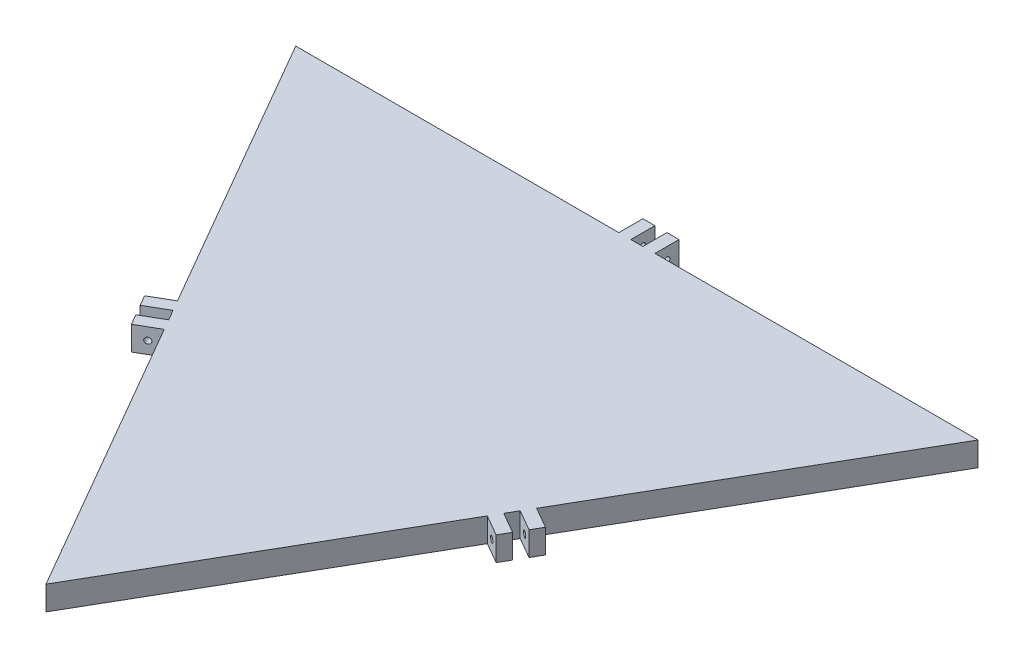
ISO-10303-21;
HEADER;
FILE_DESCRIPTION(('STEP AP214'),'2;1');
FILE_NAME('part.step','',(''),(''),'','','');
FILE_SCHEMA(('AUTOMOTIVE_DESIGN { 1 0 10303 214 1 1 1 1 }'));
ENDSEC;
DATA;
#1=APPLICATION_CONTEXT('core data for automotive mechanical design processes');
#2=APPLICATION_PROTOCOL_DEFINITION('international standard','automotive_design',2000,#1);
#3=PRODUCT_CONTEXT('',#1,'mechanical');
#4=PRODUCT('Part','Part','',(#3));
#5=PRODUCT_RELATED_PRODUCT_CATEGORY('part','',(#4));
#6=PRODUCT_DEFINITION_FORMATION('','',#4);
#7=PRODUCT_DEFINITION_CONTEXT('part definition',#1,'design');
#8=PRODUCT_DEFINITION('design','',#6,#7);
#9=PRODUCT_DEFINITION_SHAPE('','',#8);
#10=(LENGTH_UNIT() NAMED_UNIT(*) SI_UNIT(.MILLI.,.METRE.));
#11=(NAMED_UNIT(*) PLANE_ANGLE_UNIT() SI_UNIT($,.RADIAN.));
#12=(NAMED_UNIT(*) SI_UNIT($,.STERADIAN.) SOLID_ANGLE_UNIT());
#13=UNCERTAINTY_MEASURE_WITH_UNIT(LENGTH_MEASURE(1.E-05),#10,'distance_accuracy_value','');
#14=(GEOMETRIC_REPRESENTATION_CONTEXT(3) GLOBAL_UNCERTAINTY_ASSIGNED_CONTEXT((#13)) GLOBAL_UNIT_ASSIGNED_CONTEXT((#10,
#11,#12)) REPRESENTATION_CONTEXT('',''));
#15=CARTESIAN_POINT('',(0.,0.,0.));
#16=DIRECTION('',(0.,0.,1.));
#17=DIRECTION('',(1.,0.,0.));
#18=AXIS2_PLACEMENT_3D('',#15,#16,#17);
#19=CARTESIAN_POINT('',(-283.5,20.,-163.678801315259));
#20=DIRECTION('',(0.,0.,-1.));
#21=DIRECTION('',(-1.,0.,0.));
#22=AXIS2_PLACEMENT_3D('',#19,#20,#21);
#23=PLANE('',#22);
#24=DIRECTION('',(0.,-1.,0.));
#25=VECTOR('',#24,1.);
#26=CARTESIAN_POINT('',(4.99999999999985,20.,-163.678801315259));
#27=LINE('',#26,#25);
#28=CARTESIAN_POINT('',(4.99999999999984,20.,-163.678801315259));
#29=VERTEX_POINT('',#28);
#30=CARTESIAN_POINT('',(4.99999999999984,0.,-163.678801315259));
#31=VERTEX_POINT('',#30);
#32=EDGE_CURVE('E95',#29,#31,#27,.T.);
#33=ORIENTED_EDGE('',*,*,#32,.T.);
#34=DIRECTION('',(1.,0.,0.));
#35=VECTOR('',#34,1.);
#36=CARTESIAN_POINT('',(-283.5,0.,-163.678801315259));
#37=LINE('',#36,#35);
#38=CARTESIAN_POINT('',(-5.00000000000017,0.,-163.678801315259));
#39=VERTEX_POINT('',#38);
#40=EDGE_CURVE('E529',#39,#31,#37,.T.);
#41=ORIENTED_EDGE('',*,*,#40,.F.);
#42=DIRECTION('',(0.,1.,0.));
#43=VECTOR('',#42,1.);
#44=CARTESIAN_POINT('',(-5.00000000000017,20.,-163.678801315259));
#45=LINE('',#44,#43);
#46=CARTESIAN_POINT('',(-5.00000000000017,20.,-163.678801315259));
#47=VERTEX_POINT('',#46);
#48=EDGE_CURVE('E262',#39,#47,#45,.T.);
#49=ORIENTED_EDGE('',*,*,#48,.T.);
#50=DIRECTION('',(1.,0.,0.));
#51=VECTOR('',#50,1.);
#52=CARTESIAN_POINT('',(-283.5,20.,-163.678801315259));
#53=LINE('',#52,#51);
#54=EDGE_CURVE('E524',#47,#29,#53,.T.);
#55=ORIENTED_EDGE('',*,*,#54,.T.);
#56=EDGE_LOOP('',(#33,#41,#49,#55));
#57=FACE_BOUND('',#56,.T.);
#58=ADVANCED_FACE('F69',(#57),#23,.T.);
#59=DIRECTION('',(0.,1.,0.));
#60=VECTOR('',#59,1.);
#61=CARTESIAN_POINT('',(14.9999999999999,20.,-163.678801315259));
#62=LINE('',#61,#60);
#63=CARTESIAN_POINT('',(14.9999999999998,0.,-163.678801315259));
#64=VERTEX_POINT('',#63);
#65=CARTESIAN_POINT('',(14.9999999999999,20.,-163.678801315259));
#66=VERTEX_POINT('',#65);
#67=EDGE_CURVE('E274',#64,#66,#62,.T.);
#68=ORIENTED_EDGE('',*,*,#67,.T.);
#69=CARTESIAN_POINT('',(283.5,20.,-163.678801315259));
#70=VERTEX_POINT('',#69);
#71=EDGE_CURVE('E525',#66,#70,#53,.T.);
#72=ORIENTED_EDGE('',*,*,#71,.T.);
#73=DIRECTION('',(0.,-1.,0.));
#74=VECTOR('',#73,1.);
#75=CARTESIAN_POINT('',(283.5,20.,-163.678801315259));
#76=LINE('',#75,#74);
#77=CARTESIAN_POINT('',(283.5,0.,-163.678801315259));
#78=VERTEX_POINT('',#77);
#79=EDGE_CURVE('E73',#70,#78,#76,.T.);
#80=ORIENTED_EDGE('',*,*,#79,.T.);
#81=EDGE_CURVE('E87',#64,#78,#37,.T.);
#82=ORIENTED_EDGE('',*,*,#81,.F.);
#83=EDGE_LOOP('',(#68,#72,#80,#82));
#84=FACE_BOUND('',#83,.T.);
#85=ADVANCED_FACE('F71',(#84),#23,.T.);
#86=CARTESIAN_POINT('',(-283.5,20.,-163.678801315259));
#87=VERTEX_POINT('',#86);
#88=CARTESIAN_POINT('',(-15.0000000000002,20.,-163.678801315259));
#89=VERTEX_POINT('',#88);
#90=EDGE_CURVE('E519',#87,#89,#53,.T.);
#91=ORIENTED_EDGE('',*,*,#90,.T.);
#92=DIRECTION('',(0.,-1.,0.));
#93=VECTOR('',#92,1.);
#94=CARTESIAN_POINT('',(-15.0000000000002,20.,-163.678801315259));
#95=LINE('',#94,#93);
#96=CARTESIAN_POINT('',(-15.0000000000002,0.,-163.678801315259));
#97=VERTEX_POINT('',#96);
#98=EDGE_CURVE('E309',#89,#97,#95,.T.);
#99=ORIENTED_EDGE('',*,*,#98,.T.);
#100=CARTESIAN_POINT('',(-283.5,0.,-163.678801315259));
#101=VERTEX_POINT('',#100);
#102=EDGE_CURVE('E526',#101,#97,#37,.T.);
#103=ORIENTED_EDGE('',*,*,#102,.F.);
#104=DIRECTION('',(0.,-1.,0.));
#105=VECTOR('',#104,1.);
#106=CARTESIAN_POINT('',(-283.5,20.,-163.678801315259));
#107=LINE('',#106,#105);
#108=EDGE_CURVE('E523',#87,#101,#107,.T.);
#109=ORIENTED_EDGE('',*,*,#108,.F.);
#110=EDGE_LOOP('',(#91,#99,#103,#109));
#111=FACE_BOUND('',#110,.T.);
#112=ADVANCED_FACE('F601',(#111),#23,.T.);
#113=CARTESIAN_POINT('',(-141.75,20.,81.8394006576295));
#114=DIRECTION('',(-0.866025403784439,0.,0.5));
#115=DIRECTION('',(0.5,0.,0.866025403784439));
#116=AXIS2_PLACEMENT_3D('',#113,#114,#115);
#117=PLANE('',#116);
#118=DIRECTION('',(0.,-1.,0.));
#119=VECTOR('',#118,1.);
#120=CARTESIAN_POINT('',(-144.25,20.,77.5092736387074));
#121=LINE('',#120,#119);
#122=CARTESIAN_POINT('',(-144.25,20.,77.5092736387073));
#123=VERTEX_POINT('',#122);
#124=CARTESIAN_POINT('',(-144.25,0.,77.5092736387073));
#125=VERTEX_POINT('',#124);
#126=EDGE_CURVE('E339',#123,#125,#121,.T.);
#127=ORIENTED_EDGE('',*,*,#126,.T.);
#128=DIRECTION('',(-0.5,0.,-0.866025403784439));
#129=VECTOR('',#128,1.);
#130=CARTESIAN_POINT('',(-141.75,0.,81.8394006576295));
#131=LINE('',#130,#129);
#132=CARTESIAN_POINT('',(-139.25,0.,86.1695276765518));
#133=VERTEX_POINT('',#132);
#134=EDGE_CURVE('E517',#133,#125,#131,.T.);
#135=ORIENTED_EDGE('',*,*,#134,.F.);
#136=DIRECTION('',(0.,1.,0.));
#137=VECTOR('',#136,1.);
#138=CARTESIAN_POINT('',(-139.25,20.,86.1695276765518));
#139=LINE('',#138,#137);
#140=CARTESIAN_POINT('',(-139.25,20.,86.1695276765518));
#141=VERTEX_POINT('',#140);
#142=EDGE_CURVE('E377',#133,#141,#139,.T.);
#143=ORIENTED_EDGE('',*,*,#142,.T.);
#144=DIRECTION('',(-0.5,0.,-0.866025403784439));
#145=VECTOR('',#144,1.);
#146=CARTESIAN_POINT('',(-141.75,20.,81.8394006576295));
#147=LINE('',#146,#145);
#148=EDGE_CURVE('E507',#141,#123,#147,.T.);
#149=ORIENTED_EDGE('',*,*,#148,.T.);
#150=EDGE_LOOP('',(#127,#135,#143,#149));
#151=FACE_BOUND('',#150,.T.);
#152=ADVANCED_FACE('F605',(#151),#117,.T.);
#153=DIRECTION('',(0.,1.,0.));
#154=VECTOR('',#153,1.);
#155=CARTESIAN_POINT('',(-149.25,20.,68.849019600863));
#156=LINE('',#155,#154);
#157=CARTESIAN_POINT('',(-149.25,0.,68.849019600863));
#158=VERTEX_POINT('',#157);
#159=CARTESIAN_POINT('',(-149.25,20.,68.849019600863));
#160=VERTEX_POINT('',#159);
#161=EDGE_CURVE('E345',#158,#160,#156,.T.);
#162=ORIENTED_EDGE('',*,*,#161,.T.);
#163=EDGE_CURVE('E501',#160,#87,#147,.T.);
#164=ORIENTED_EDGE('',*,*,#163,.T.);
#165=ORIENTED_EDGE('',*,*,#108,.T.);
#166=EDGE_CURVE('E511',#158,#101,#131,.T.);
#167=ORIENTED_EDGE('',*,*,#166,.F.);
#168=EDGE_LOOP('',(#162,#164,#165,#167));
#169=FACE_BOUND('',#168,.T.);
#170=ADVANCED_FACE('F609',(#169),#117,.T.);
#171=CARTESIAN_POINT('',(0.,20.,327.357602630518));
#172=VERTEX_POINT('',#171);
#173=CARTESIAN_POINT('',(-134.25,20.,94.8297817143962));
#174=VERTEX_POINT('',#173);
#175=EDGE_CURVE('E79',#172,#174,#147,.T.);
#176=ORIENTED_EDGE('',*,*,#175,.T.);
#177=DIRECTION('',(0.,-1.,0.));
#178=VECTOR('',#177,1.);
#179=CARTESIAN_POINT('',(-134.25,20.,94.8297817143962));
#180=LINE('',#179,#178);
#181=CARTESIAN_POINT('',(-134.25,0.,94.8297817143961));
#182=VERTEX_POINT('',#181);
#183=EDGE_CURVE('E383',#174,#182,#180,.T.);
#184=ORIENTED_EDGE('',*,*,#183,.T.);
#185=CARTESIAN_POINT('',(0.,0.,327.357602630518));
#186=VERTEX_POINT('',#185);
#187=EDGE_CURVE('E514',#186,#182,#131,.T.);
#188=ORIENTED_EDGE('',*,*,#187,.F.);
#189=DIRECTION('',(0.,-1.,0.));
#190=VECTOR('',#189,1.);
#191=CARTESIAN_POINT('',(0.,20.,327.357602630518));
#192=LINE('',#191,#190);
#193=EDGE_CURVE('E12',#172,#186,#192,.T.);
#194=ORIENTED_EDGE('',*,*,#193,.F.);
#195=EDGE_LOOP('',(#176,#184,#188,#194));
#196=FACE_BOUND('',#195,.T.);
#197=ADVANCED_FACE('F578',(#196),#117,.T.);
#198=CARTESIAN_POINT('',(141.75,20.,81.8394006576295));
#199=DIRECTION('',(-0.866025403784439,0.,-0.5));
#200=DIRECTION('',(-0.5,0.,0.866025403784439));
#201=AXIS2_PLACEMENT_3D('',#198,#199,#200);
#202=PLANE('',#201);
#203=DIRECTION('',(0.,-1.,0.));
#204=VECTOR('',#203,1.);
#205=CARTESIAN_POINT('',(144.25,20.,77.5092736387074));
#206=LINE('',#205,#204);
#207=CARTESIAN_POINT('',(144.25,20.,77.5092736387074));
#208=VERTEX_POINT('',#207);
#209=CARTESIAN_POINT('',(144.25,0.,77.5092736387074));
#210=VERTEX_POINT('',#209);
#211=EDGE_CURVE('E446',#208,#210,#206,.T.);
#212=ORIENTED_EDGE('',*,*,#211,.F.);
#213=DIRECTION('',(0.5,0.,-0.866025403784439));
#214=VECTOR('',#213,1.);
#215=CARTESIAN_POINT('',(141.75,20.,81.8394006576295));
#216=LINE('',#215,#214);
#217=CARTESIAN_POINT('',(139.25,20.,86.1695276765518));
#218=VERTEX_POINT('',#217);
#219=EDGE_CURVE('E502',#218,#208,#216,.T.);
#220=ORIENTED_EDGE('',*,*,#219,.F.);
#221=DIRECTION('',(0.,1.,0.));
#222=VECTOR('',#221,1.);
#223=CARTESIAN_POINT('',(139.25,20.,86.1695276765518));
#224=LINE('',#223,#222);
#225=CARTESIAN_POINT('',(139.25,0.,86.1695276765518));
#226=VERTEX_POINT('',#225);
#227=EDGE_CURVE('E451',#226,#218,#224,.T.);
#228=ORIENTED_EDGE('',*,*,#227,.F.);
#229=DIRECTION('',(0.5,0.,-0.866025403784439));
#230=VECTOR('',#229,1.);
#231=CARTESIAN_POINT('',(141.75,0.,81.8394006576295));
#232=LINE('',#231,#230);
#233=EDGE_CURVE('E512',#226,#210,#232,.T.);
#234=ORIENTED_EDGE('',*,*,#233,.T.);
#235=EDGE_LOOP('',(#212,#220,#228,#234));
#236=FACE_BOUND('',#235,.T.);
#237=ADVANCED_FACE('F552',(#236),#202,.F.);
#238=DIRECTION('',(0.,1.,0.));
#239=VECTOR('',#238,1.);
#240=CARTESIAN_POINT('',(149.25,20.,68.849019600863));
#241=LINE('',#240,#239);
#242=CARTESIAN_POINT('',(149.25,0.,68.849019600863));
#243=VERTEX_POINT('',#242);
#244=CARTESIAN_POINT('',(149.25,20.,68.849019600863));
#245=VERTEX_POINT('',#244);
#246=EDGE_CURVE('E442',#243,#245,#241,.T.);
#247=ORIENTED_EDGE('',*,*,#246,.F.);
#248=EDGE_CURVE('E513',#243,#78,#232,.T.);
#249=ORIENTED_EDGE('',*,*,#248,.T.);
#250=ORIENTED_EDGE('',*,*,#79,.F.);
#251=EDGE_CURVE('E503',#245,#70,#216,.T.);
#252=ORIENTED_EDGE('',*,*,#251,.F.);
#253=EDGE_LOOP('',(#247,#249,#250,#252));
#254=FACE_BOUND('',#253,.T.);
#255=ADVANCED_FACE('F641',(#254),#202,.F.);
#256=DIRECTION('',(0.,-1.,0.));
#257=VECTOR('',#256,1.);
#258=CARTESIAN_POINT('',(134.25,20.,94.8297817143962));
#259=LINE('',#258,#257);
#260=CARTESIAN_POINT('',(134.25,20.,94.8297817143961));
#261=VERTEX_POINT('',#260);
#262=CARTESIAN_POINT('',(134.25,0.,94.8297817143961));
#263=VERTEX_POINT('',#262);
#264=EDGE_CURVE('E468',#261,#263,#259,.T.);
#265=ORIENTED_EDGE('',*,*,#264,.F.);
#266=EDGE_CURVE('E498',#172,#261,#216,.T.);
#267=ORIENTED_EDGE('',*,*,#266,.F.);
#268=ORIENTED_EDGE('',*,*,#193,.T.);
#269=EDGE_CURVE('E508',#186,#263,#232,.T.);
#270=ORIENTED_EDGE('',*,*,#269,.T.);
#271=EDGE_LOOP('',(#265,#267,#268,#270));
#272=FACE_BOUND('',#271,.T.);
#273=ADVANCED_FACE('F574',(#272),#202,.F.);
#274=CARTESIAN_POINT('',(0.,0.,0.));
#275=DIRECTION('',(0.,1.,0.));
#276=DIRECTION('',(0.,0.,1.));
#277=AXIS2_PLACEMENT_3D('',#274,#275,#276);
#278=PLANE('',#277);
#279=ORIENTED_EDGE('',*,*,#269,.F.);
#280=ORIENTED_EDGE('',*,*,#187,.T.);
#281=DIRECTION('',(0.866025403784438,0.,-0.5));
#282=VECTOR('',#281,1.);
#283=CARTESIAN_POINT('',(-151.570508075689,0.,104.829781714396));
#284=LINE('',#283,#282);
#285=CARTESIAN_POINT('',(-151.570508075689,0.,104.829781714396));
#286=VERTEX_POINT('',#285);
#287=EDGE_CURVE('E407',#286,#182,#284,.T.);
#288=ORIENTED_EDGE('',*,*,#287,.F.);
#289=DIRECTION('',(-0.500000000000001,0.,-0.866025403784438));
#290=VECTOR('',#289,1.);
#291=CARTESIAN_POINT('',(-156.570508075689,0.,96.1695276765518));
#292=LINE('',#291,#290);
#293=CARTESIAN_POINT('',(-156.570508075689,0.,96.1695276765518));
#294=VERTEX_POINT('',#293);
#295=EDGE_CURVE('E382',#286,#294,#292,.T.);
#296=ORIENTED_EDGE('',*,*,#295,.T.);
#297=DIRECTION('',(0.866025403784438,0.,-0.5));
#298=VECTOR('',#297,1.);
#299=CARTESIAN_POINT('',(-156.570508075689,0.,96.1695276765518));
#300=LINE('',#299,#298);
#301=EDGE_CURVE('E410',#294,#133,#300,.T.);
#302=ORIENTED_EDGE('',*,*,#301,.T.);
#303=ORIENTED_EDGE('',*,*,#134,.T.);
#304=DIRECTION('',(0.866025403784438,0.,-0.5));
#305=VECTOR('',#304,1.);
#306=CARTESIAN_POINT('',(-161.570508075689,0.,87.5092736387074));
#307=LINE('',#306,#305);
#308=CARTESIAN_POINT('',(-161.570508075689,0.,87.5092736387074));
#309=VERTEX_POINT('',#308);
#310=EDGE_CURVE('E357',#309,#125,#307,.T.);
#311=ORIENTED_EDGE('',*,*,#310,.F.);
#312=DIRECTION('',(-0.5,0.,-0.866025403784438));
#313=VECTOR('',#312,1.);
#314=CARTESIAN_POINT('',(-161.570508075689,0.,87.5092736387074));
#315=LINE('',#314,#313);
#316=CARTESIAN_POINT('',(-166.570508075689,0.,78.849019600863));
#317=VERTEX_POINT('',#316);
#318=EDGE_CURVE('E353',#309,#317,#315,.T.);
#319=ORIENTED_EDGE('',*,*,#318,.T.);
#320=DIRECTION('',(0.866025403784438,0.,-0.5));
#321=VECTOR('',#320,1.);
#322=CARTESIAN_POINT('',(-166.570508075689,0.,78.849019600863));
#323=LINE('',#322,#321);
#324=EDGE_CURVE('E366',#317,#158,#323,.T.);
#325=ORIENTED_EDGE('',*,*,#324,.T.);
#326=ORIENTED_EDGE('',*,*,#166,.T.);
#327=ORIENTED_EDGE('',*,*,#102,.T.);
#328=DIRECTION('',(0.,0.,1.));
#329=VECTOR('',#328,1.);
#330=CARTESIAN_POINT('',(-15.0000000000002,0.,-183.678801315259));
#331=LINE('',#330,#329);
#332=CARTESIAN_POINT('',(-15.0000000000002,0.,-183.678801315259));
#333=VERTEX_POINT('',#332);
#334=EDGE_CURVE('E333',#333,#97,#331,.T.);
#335=ORIENTED_EDGE('',*,*,#334,.F.);
#336=DIRECTION('',(1.,0.,0.));
#337=VECTOR('',#336,1.);
#338=CARTESIAN_POINT('',(-5.00000000000018,0.,-183.678801315259));
#339=LINE('',#338,#337);
#340=CARTESIAN_POINT('',(-5.00000000000018,0.,-183.678801315259));
#341=VERTEX_POINT('',#340);
#342=EDGE_CURVE('E308',#333,#341,#339,.T.);
#343=ORIENTED_EDGE('',*,*,#342,.T.);
#344=DIRECTION('',(0.,0.,1.));
#345=VECTOR('',#344,1.);
#346=CARTESIAN_POINT('',(-5.00000000000018,0.,-183.678801315259));
#347=LINE('',#346,#345);
#348=EDGE_CURVE('E336',#341,#39,#347,.T.);
#349=ORIENTED_EDGE('',*,*,#348,.T.);
#350=ORIENTED_EDGE('',*,*,#40,.T.);
#351=DIRECTION('',(0.,0.,1.));
#352=VECTOR('',#351,1.);
#353=CARTESIAN_POINT('',(4.99999999999984,0.,-183.678801315259));
#354=LINE('',#353,#352);
#355=CARTESIAN_POINT('',(4.99999999999984,0.,-183.678801315259));
#356=VERTEX_POINT('',#355);
#357=EDGE_CURVE('E291',#356,#31,#354,.T.);
#358=ORIENTED_EDGE('',*,*,#357,.F.);
#359=DIRECTION('',(1.,0.,0.));
#360=VECTOR('',#359,1.);
#361=CARTESIAN_POINT('',(4.99999999999984,0.,-183.678801315259));
#362=LINE('',#361,#360);
#363=CARTESIAN_POINT('',(14.9999999999998,0.,-183.678801315259));
#364=VERTEX_POINT('',#363);
#365=EDGE_CURVE('E272',#356,#364,#362,.T.);
#366=ORIENTED_EDGE('',*,*,#365,.T.);
#367=DIRECTION('',(0.,0.,1.));
#368=VECTOR('',#367,1.);
#369=CARTESIAN_POINT('',(14.9999999999998,0.,-183.678801315259));
#370=LINE('',#369,#368);
#371=EDGE_CURVE('E299',#364,#64,#370,.T.);
#372=ORIENTED_EDGE('',*,*,#371,.T.);
#373=ORIENTED_EDGE('',*,*,#81,.T.);
#374=ORIENTED_EDGE('',*,*,#248,.F.);
#375=DIRECTION('',(-0.866025403784438,0.,-0.5));
#376=VECTOR('',#375,1.);
#377=CARTESIAN_POINT('',(166.570508075689,0.,78.849019600863));
#378=LINE('',#377,#376);
#379=CARTESIAN_POINT('',(166.570508075689,0.,78.849019600863));
#380=VERTEX_POINT('',#379);
#381=EDGE_CURVE('E432',#380,#243,#378,.T.);
#382=ORIENTED_EDGE('',*,*,#381,.F.);
#383=DIRECTION('',(0.5,0.,-0.866025403784438));
#384=VECTOR('',#383,1.);
#385=CARTESIAN_POINT('',(161.570508075689,0.,87.5092736387074));
#386=LINE('',#385,#384);
#387=CARTESIAN_POINT('',(161.570508075689,0.,87.5092736387074));
#388=VERTEX_POINT('',#387);
#389=EDGE_CURVE('E457',#388,#380,#386,.T.);
#390=ORIENTED_EDGE('',*,*,#389,.F.);
#391=DIRECTION('',(-0.866025403784438,0.,-0.5));
#392=VECTOR('',#391,1.);
#393=CARTESIAN_POINT('',(161.570508075689,0.,87.5092736387074));
#394=LINE('',#393,#392);
#395=EDGE_CURVE('E429',#388,#210,#394,.T.);
#396=ORIENTED_EDGE('',*,*,#395,.T.);
#397=ORIENTED_EDGE('',*,*,#233,.F.);
#398=DIRECTION('',(-0.866025403784438,0.,-0.5));
#399=VECTOR('',#398,1.);
#400=CARTESIAN_POINT('',(156.570508075689,0.,96.1695276765518));
#401=LINE('',#400,#399);
#402=CARTESIAN_POINT('',(156.570508075689,0.,96.1695276765518));
#403=VERTEX_POINT('',#402);
#404=EDGE_CURVE('E476',#403,#226,#401,.T.);
#405=ORIENTED_EDGE('',*,*,#404,.F.);
#406=DIRECTION('',(0.500000000000001,0.,-0.866025403784438));
#407=VECTOR('',#406,1.);
#408=CARTESIAN_POINT('',(156.570508075689,0.,96.1695276765518));
#409=LINE('',#408,#407);
#410=CARTESIAN_POINT('',(151.570508075689,0.,104.829781714396));
#411=VERTEX_POINT('',#410);
#412=EDGE_CURVE('E474',#411,#403,#409,.T.);
#413=ORIENTED_EDGE('',*,*,#412,.F.);
#414=DIRECTION('',(-0.866025403784438,0.,-0.5));
#415=VECTOR('',#414,1.);
#416=CARTESIAN_POINT('',(151.570508075689,0.,104.829781714396));
#417=LINE('',#416,#415);
#418=EDGE_CURVE('E486',#411,#263,#417,.T.);
#419=ORIENTED_EDGE('',*,*,#418,.T.);
#420=EDGE_LOOP('',(#279,#280,#288,#296,#302,#303,#311,#319,#325,#326,#327,#335,#343,#349,#350,
#358,#366,#372,#373,#374,#382,#390,#396,#397,#405,#413,#419));
#421=FACE_BOUND('',#420,.T.);
#422=ADVANCED_FACE('F557',(#421),#278,.F.);
#423=CARTESIAN_POINT('',(0.,20.,0.));
#424=DIRECTION('',(0.,1.,0.));
#425=DIRECTION('',(0.,0.,1.));
#426=AXIS2_PLACEMENT_3D('',#423,#424,#425);
#427=PLANE('',#426);
#428=ORIENTED_EDGE('',*,*,#266,.T.);
#429=DIRECTION('',(-0.866025403784438,0.,-0.5));
#430=VECTOR('',#429,1.);
#431=CARTESIAN_POINT('',(151.570508075689,20.,104.829781714396));
#432=LINE('',#431,#430);
#433=CARTESIAN_POINT('',(151.570508075689,20.,104.829781714396));
#434=VERTEX_POINT('',#433);
#435=EDGE_CURVE('E490',#434,#261,#432,.T.);
#436=ORIENTED_EDGE('',*,*,#435,.F.);
#437=DIRECTION('',(-0.5,0.,0.866025403784438));
#438=VECTOR('',#437,1.);
#439=CARTESIAN_POINT('',(156.570508075689,20.,96.1695276765518));
#440=LINE('',#439,#438);
#441=CARTESIAN_POINT('',(156.570508075689,20.,96.1695276765518));
#442=VERTEX_POINT('',#441);
#443=EDGE_CURVE('E467',#442,#434,#440,.T.);
#444=ORIENTED_EDGE('',*,*,#443,.F.);
#445=DIRECTION('',(-0.866025403784438,0.,-0.5));
#446=VECTOR('',#445,1.);
#447=CARTESIAN_POINT('',(156.570508075689,20.,96.1695276765518));
#448=LINE('',#447,#446);
#449=EDGE_CURVE('E494',#442,#218,#448,.T.);
#450=ORIENTED_EDGE('',*,*,#449,.T.);
#451=ORIENTED_EDGE('',*,*,#219,.T.);
#452=DIRECTION('',(-0.866025403784438,0.,-0.5));
#453=VECTOR('',#452,1.);
#454=CARTESIAN_POINT('',(161.570508075689,20.,87.5092736387074));
#455=LINE('',#454,#453);
#456=CARTESIAN_POINT('',(161.570508075689,20.,87.5092736387074));
#457=VERTEX_POINT('',#456);
#458=EDGE_CURVE('E438',#457,#208,#455,.T.);
#459=ORIENTED_EDGE('',*,*,#458,.F.);
#460=DIRECTION('',(-0.5,0.,0.866025403784438));
#461=VECTOR('',#460,1.);
#462=CARTESIAN_POINT('',(161.570508075689,20.,87.5092736387074));
#463=LINE('',#462,#461);
#464=CARTESIAN_POINT('',(166.570508075689,20.,78.849019600863));
#465=VERTEX_POINT('',#464);
#466=EDGE_CURVE('E441',#465,#457,#463,.T.);
#467=ORIENTED_EDGE('',*,*,#466,.F.);
#468=DIRECTION('',(-0.866025403784438,0.,-0.5));
#469=VECTOR('',#468,1.);
#470=CARTESIAN_POINT('',(166.570508075689,20.,78.849019600863));
#471=LINE('',#470,#469);
#472=EDGE_CURVE('E435',#465,#245,#471,.T.);
#473=ORIENTED_EDGE('',*,*,#472,.T.);
#474=ORIENTED_EDGE('',*,*,#251,.T.);
#475=ORIENTED_EDGE('',*,*,#71,.F.);
#476=DIRECTION('',(0.,0.,1.));
#477=VECTOR('',#476,1.);
#478=CARTESIAN_POINT('',(14.9999999999998,20.,-183.678801315259));
#479=LINE('',#478,#477);
#480=CARTESIAN_POINT('',(14.9999999999998,20.,-183.678801315259));
#481=VERTEX_POINT('',#480);
#482=EDGE_CURVE('E263',#481,#66,#479,.T.);
#483=ORIENTED_EDGE('',*,*,#482,.F.);
#484=DIRECTION('',(-1.,0.,0.));
#485=VECTOR('',#484,1.);
#486=CARTESIAN_POINT('',(4.99999999999984,20.,-183.678801315259));
#487=LINE('',#486,#485);
#488=CARTESIAN_POINT('',(4.99999999999984,20.,-183.678801315259));
#489=VERTEX_POINT('',#488);
#490=EDGE_CURVE('E269',#481,#489,#487,.T.);
#491=ORIENTED_EDGE('',*,*,#490,.T.);
#492=DIRECTION('',(0.,0.,1.));
#493=VECTOR('',#492,1.);
#494=CARTESIAN_POINT('',(4.99999999999984,20.,-183.678801315259));
#495=LINE('',#494,#493);
#496=EDGE_CURVE('E252',#489,#29,#495,.T.);
#497=ORIENTED_EDGE('',*,*,#496,.T.);
#498=ORIENTED_EDGE('',*,*,#54,.F.);
#499=DIRECTION('',(0.,0.,1.));
#500=VECTOR('',#499,1.);
#501=CARTESIAN_POINT('',(-5.00000000000018,20.,-183.678801315259));
#502=LINE('',#501,#500);
#503=CARTESIAN_POINT('',(-5.00000000000018,20.,-183.678801315259));
#504=VERTEX_POINT('',#503);
#505=EDGE_CURVE('E321',#504,#47,#502,.T.);
#506=ORIENTED_EDGE('',*,*,#505,.F.);
#507=DIRECTION('',(-1.,0.,0.));
#508=VECTOR('',#507,1.);
#509=CARTESIAN_POINT('',(-5.00000000000018,20.,-183.678801315259));
#510=LINE('',#509,#508);
#511=CARTESIAN_POINT('',(-15.0000000000002,20.,-183.678801315259));
#512=VERTEX_POINT('',#511);
#513=EDGE_CURVE('E317',#504,#512,#510,.T.);
#514=ORIENTED_EDGE('',*,*,#513,.T.);
#515=DIRECTION('',(0.,0.,1.));
#516=VECTOR('',#515,1.);
#517=CARTESIAN_POINT('',(-15.0000000000002,20.,-183.678801315259));
#518=LINE('',#517,#516);
#519=EDGE_CURVE('E330',#512,#89,#518,.T.);
#520=ORIENTED_EDGE('',*,*,#519,.T.);
#521=ORIENTED_EDGE('',*,*,#90,.F.);
#522=ORIENTED_EDGE('',*,*,#163,.F.);
#523=DIRECTION('',(0.866025403784438,0.,-0.5));
#524=VECTOR('',#523,1.);
#525=CARTESIAN_POINT('',(-166.570508075689,20.,78.849019600863));
#526=LINE('',#525,#524);
#527=CARTESIAN_POINT('',(-166.570508075689,20.,78.849019600863));
#528=VERTEX_POINT('',#527);
#529=EDGE_CURVE('E370',#528,#160,#526,.T.);
#530=ORIENTED_EDGE('',*,*,#529,.F.);
#531=DIRECTION('',(0.5,0.,0.866025403784438));
#532=VECTOR('',#531,1.);
#533=CARTESIAN_POINT('',(-161.570508075689,20.,87.5092736387074));
#534=LINE('',#533,#532);
#535=CARTESIAN_POINT('',(-161.570508075689,20.,87.5092736387074));
#536=VERTEX_POINT('',#535);
#537=EDGE_CURVE('E344',#528,#536,#534,.T.);
#538=ORIENTED_EDGE('',*,*,#537,.T.);
#539=DIRECTION('',(0.866025403784438,0.,-0.5));
#540=VECTOR('',#539,1.);
#541=CARTESIAN_POINT('',(-161.570508075689,20.,87.5092736387074));
#542=LINE('',#541,#540);
#543=EDGE_CURVE('E374',#536,#123,#542,.T.);
#544=ORIENTED_EDGE('',*,*,#543,.T.);
#545=ORIENTED_EDGE('',*,*,#148,.F.);
#546=DIRECTION('',(0.866025403784438,0.,-0.5));
#547=VECTOR('',#546,1.);
#548=CARTESIAN_POINT('',(-156.570508075689,20.,96.1695276765518));
#549=LINE('',#548,#547);
#550=CARTESIAN_POINT('',(-156.570508075689,20.,96.1695276765518));
#551=VERTEX_POINT('',#550);
#552=EDGE_CURVE('E395',#551,#141,#549,.T.);
#553=ORIENTED_EDGE('',*,*,#552,.F.);
#554=DIRECTION('',(0.5,0.,0.866025403784438));
#555=VECTOR('',#554,1.);
#556=CARTESIAN_POINT('',(-156.570508075689,20.,96.1695276765518));
#557=LINE('',#556,#555);
#558=CARTESIAN_POINT('',(-151.570508075689,20.,104.829781714396));
#559=VERTEX_POINT('',#558);
#560=EDGE_CURVE('E391',#551,#559,#557,.T.);
#561=ORIENTED_EDGE('',*,*,#560,.T.);
#562=DIRECTION('',(0.866025403784438,0.,-0.5));
#563=VECTOR('',#562,1.);
#564=CARTESIAN_POINT('',(-151.570508075689,20.,104.829781714396));
#565=LINE('',#564,#563);
#566=EDGE_CURVE('E404',#559,#174,#565,.T.);
#567=ORIENTED_EDGE('',*,*,#566,.T.);
#568=ORIENTED_EDGE('',*,*,#175,.F.);
#569=EDGE_LOOP('',(#428,#436,#444,#450,#451,#459,#467,#473,#474,#475,#483,#491,#497,#498,#506,
#514,#520,#521,#522,#530,#538,#544,#545,#553,#561,#567,#568));
#570=FACE_BOUND('',#569,.T.);
#571=ADVANCED_FACE('F277',(#570),#427,.T.);
#572=CARTESIAN_POINT('',(156.570508075689,20.,96.1695276765518));
#573=DIRECTION('',(-0.5,0.,0.866025403784438));
#574=DIRECTION('',(0.866025403784438,0.,0.5));
#575=AXIS2_PLACEMENT_3D('',#572,#573,#574);
#576=PLANE('',#575);
#577=CARTESIAN_POINT('',(147.910254037844,9.99999999999999,91.1695276765518));
#578=DIRECTION('',(-0.5,0.,0.866025403784438));
#579=DIRECTION('',(0.866025403784438,0.,0.5));
#580=AXIS2_PLACEMENT_3D('',#577,#578,#579);
#581=CIRCLE('',#580,2.5);
#582=CARTESIAN_POINT('',(150.075317547305,9.99999999999999,92.4195276765518));
#583=VERTEX_POINT('',#582);
#584=EDGE_CURVE('E425',#583,#583,#581,.T.);
#585=ORIENTED_EDGE('',*,*,#584,.T.);
#586=EDGE_LOOP('',(#585));
#587=FACE_BOUND('',#586,.T.);
#588=ORIENTED_EDGE('',*,*,#227,.T.);
#589=ORIENTED_EDGE('',*,*,#449,.F.);
#590=DIRECTION('',(0.,1.,0.));
#591=VECTOR('',#590,1.);
#592=CARTESIAN_POINT('',(156.570508075689,20.,96.1695276765518));
#593=LINE('',#592,#591);
#594=EDGE_CURVE('E463',#403,#442,#593,.T.);
#595=ORIENTED_EDGE('',*,*,#594,.F.);
#596=ORIENTED_EDGE('',*,*,#404,.T.);
#597=EDGE_LOOP('',(#588,#589,#595,#596));
#598=FACE_BOUND('',#597,.T.);
#599=ADVANCED_FACE('F562',(#587,#598),#576,.F.);
#600=CARTESIAN_POINT('',(151.570508075689,20.,104.829781714396));
#601=DIRECTION('',(0.5,0.,-0.866025403784438));
#602=DIRECTION('',(-0.866025403784438,0.,-0.5));
#603=AXIS2_PLACEMENT_3D('',#600,#601,#602);
#604=PLANE('',#603);
#605=CARTESIAN_POINT('',(142.910254037844,10.,99.8297817143961));
#606=DIRECTION('',(-0.5,0.,0.866025403784438));
#607=DIRECTION('',(0.866025403784439,0.,0.5));
#608=AXIS2_PLACEMENT_3D('',#605,#606,#607);
#609=CIRCLE('',#608,2.5);
#610=CARTESIAN_POINT('',(145.075317547305,10.,101.079781714396));
#611=VERTEX_POINT('',#610);
#612=EDGE_CURVE('E413',#611,#611,#609,.T.);
#613=ORIENTED_EDGE('',*,*,#612,.F.);
#614=EDGE_LOOP('',(#613));
#615=FACE_BOUND('',#614,.T.);
#616=ORIENTED_EDGE('',*,*,#264,.T.);
#617=ORIENTED_EDGE('',*,*,#418,.F.);
#618=DIRECTION('',(0.,-1.,0.));
#619=VECTOR('',#618,1.);
#620=CARTESIAN_POINT('',(151.570508075689,20.,104.829781714396));
#621=LINE('',#620,#619);
#622=EDGE_CURVE('E471',#434,#411,#621,.T.);
#623=ORIENTED_EDGE('',*,*,#622,.F.);
#624=ORIENTED_EDGE('',*,*,#435,.T.);
#625=EDGE_LOOP('',(#616,#617,#623,#624));
#626=FACE_BOUND('',#625,.T.);
#627=ADVANCED_FACE('F571',(#615,#626),#604,.F.);
#628=CARTESIAN_POINT('',(159.070508075689,0.,91.8394006576296));
#629=DIRECTION('',(-0.866025403784438,0.,-0.500000000000001));
#630=DIRECTION('',(-0.500000000000001,0.,0.866025403784438));
#631=AXIS2_PLACEMENT_3D('',#628,#629,#630);
#632=PLANE('',#631);
#633=ORIENTED_EDGE('',*,*,#594,.T.);
#634=ORIENTED_EDGE('',*,*,#443,.T.);
#635=ORIENTED_EDGE('',*,*,#622,.T.);
#636=ORIENTED_EDGE('',*,*,#412,.T.);
#637=EDGE_LOOP('',(#633,#634,#635,#636));
#638=FACE_BOUND('',#637,.T.);
#639=ADVANCED_FACE('F565',(#638),#632,.F.);
#640=CARTESIAN_POINT('',(161.570508075689,20.,87.5092736387074));
#641=DIRECTION('',(0.5,0.,-0.866025403784438));
#642=DIRECTION('',(-0.866025403784438,0.,-0.5));
#643=AXIS2_PLACEMENT_3D('',#640,#641,#642);
#644=PLANE('',#643);
#645=CARTESIAN_POINT('',(152.910254037844,9.99999999999999,82.5092736387074));
#646=DIRECTION('',(0.5,0.,-0.866025403784438));
#647=DIRECTION('',(-0.866025403784438,0.,-0.5));
#648=AXIS2_PLACEMENT_3D('',#645,#646,#647);
#649=CIRCLE('',#648,2.5);
#650=CARTESIAN_POINT('',(150.745190528383,9.99999999999999,81.2592736387074));
#651=VERTEX_POINT('',#650);
#652=EDGE_CURVE('E421',#651,#651,#649,.T.);
#653=ORIENTED_EDGE('',*,*,#652,.T.);
#654=EDGE_LOOP('',(#653));
#655=FACE_BOUND('',#654,.T.);
#656=ORIENTED_EDGE('',*,*,#211,.T.);
#657=ORIENTED_EDGE('',*,*,#395,.F.);
#658=DIRECTION('',(0.,-1.,0.));
#659=VECTOR('',#658,1.);
#660=CARTESIAN_POINT('',(161.570508075689,20.,87.5092736387074));
#661=LINE('',#660,#659);
#662=EDGE_CURVE('E447',#457,#388,#661,.T.);
#663=ORIENTED_EDGE('',*,*,#662,.F.);
#664=ORIENTED_EDGE('',*,*,#458,.T.);
#665=EDGE_LOOP('',(#656,#657,#663,#664));
#666=FACE_BOUND('',#665,.T.);
#667=ADVANCED_FACE('F660',(#655,#666),#644,.F.);
#668=CARTESIAN_POINT('',(166.570508075689,20.,78.849019600863));
#669=DIRECTION('',(-0.5,0.,0.866025403784438));
#670=DIRECTION('',(0.866025403784438,0.,0.5));
#671=AXIS2_PLACEMENT_3D('',#668,#669,#670);
#672=PLANE('',#671);
#673=CARTESIAN_POINT('',(157.910254037844,9.99999999999999,73.849019600863));
#674=DIRECTION('',(-0.5,0.,0.866025403784438));
#675=DIRECTION('',(0.866025403784438,0.,0.5));
#676=AXIS2_PLACEMENT_3D('',#673,#674,#675);
#677=CIRCLE('',#676,2.5);
#678=CARTESIAN_POINT('',(160.075317547305,9.99999999999999,75.099019600863));
#679=VERTEX_POINT('',#678);
#680=EDGE_CURVE('E417',#679,#679,#677,.F.);
#681=ORIENTED_EDGE('',*,*,#680,.F.);
#682=EDGE_LOOP('',(#681));
#683=FACE_BOUND('',#682,.T.);
#684=ORIENTED_EDGE('',*,*,#246,.T.);
#685=ORIENTED_EDGE('',*,*,#472,.F.);
#686=DIRECTION('',(0.,1.,0.));
#687=VECTOR('',#686,1.);
#688=CARTESIAN_POINT('',(166.570508075689,20.,78.849019600863));
#689=LINE('',#688,#687);
#690=EDGE_CURVE('E454',#380,#465,#689,.T.);
#691=ORIENTED_EDGE('',*,*,#690,.F.);
#692=ORIENTED_EDGE('',*,*,#381,.T.);
#693=EDGE_LOOP('',(#684,#685,#691,#692));
#694=FACE_BOUND('',#693,.T.);
#695=ADVANCED_FACE('F665',(#683,#694),#672,.F.);
#696=CARTESIAN_POINT('',(159.070508075689,0.,91.8394006576296));
#697=DIRECTION('',(0.866025403784438,0.,0.5));
#698=DIRECTION('',(0.5,0.,-0.866025403784438));
#699=AXIS2_PLACEMENT_3D('',#696,#697,#698);
#700=PLANE('',#699);
#701=ORIENTED_EDGE('',*,*,#662,.T.);
#702=ORIENTED_EDGE('',*,*,#389,.T.);
#703=ORIENTED_EDGE('',*,*,#690,.T.);
#704=ORIENTED_EDGE('',*,*,#466,.T.);
#705=EDGE_LOOP('',(#701,#702,#703,#704));
#706=FACE_BOUND('',#705,.T.);
#707=ADVANCED_FACE('F661',(#706),#700,.T.);
#708=CARTESIAN_POINT('',(161.445787943777,9.99999999999999,67.725295243905));
#709=DIRECTION('',(-0.5,0.,0.866025403784438));
#710=DIRECTION('',(0.866025403784439,0.,0.5));
#711=AXIS2_PLACEMENT_3D('',#708,#709,#710);
#712=CYLINDRICAL_SURFACE('',#711,2.5);
#713=ORIENTED_EDGE('',*,*,#680,.T.);
#714=EDGE_LOOP('',(#713));
#715=FACE_BOUND('',#714,.T.);
#716=ORIENTED_EDGE('',*,*,#652,.F.);
#717=EDGE_LOOP('',(#716));
#718=FACE_BOUND('',#717,.T.);
#719=ADVANCED_FACE('F664',(#715,#718),#712,.F.);
#720=ORIENTED_EDGE('',*,*,#612,.T.);
#721=EDGE_LOOP('',(#720));
#722=FACE_BOUND('',#721,.T.);
#723=ORIENTED_EDGE('',*,*,#584,.F.);
#724=EDGE_LOOP('',(#723));
#725=FACE_BOUND('',#724,.T.);
#726=ADVANCED_FACE('F596',(#722,#725),#712,.F.);
#727=CARTESIAN_POINT('',(-156.570508075689,20.,96.1695276765518));
#728=DIRECTION('',(-0.5,0.,-0.866025403784438));
#729=DIRECTION('',(-0.866025403784438,0.,0.5));
#730=AXIS2_PLACEMENT_3D('',#727,#728,#729);
#731=PLANE('',#730);
#732=CARTESIAN_POINT('',(-147.910254037844,9.99999999999999,91.1695276765518));
#733=DIRECTION('',(-0.5,0.,-0.866025403784438));
#734=DIRECTION('',(-0.866025403784438,0.,0.5));
#735=AXIS2_PLACEMENT_3D('',#732,#733,#734);
#736=CIRCLE('',#735,2.5);
#737=CARTESIAN_POINT('',(-150.075317547305,9.99999999999999,92.4195276765518));
#738=VERTEX_POINT('',#737);
#739=EDGE_CURVE('E294',#738,#738,#736,.F.);
#740=ORIENTED_EDGE('',*,*,#739,.T.);
#741=EDGE_LOOP('',(#740));
#742=FACE_BOUND('',#741,.T.);
#743=ORIENTED_EDGE('',*,*,#142,.F.);
#744=ORIENTED_EDGE('',*,*,#301,.F.);
#745=DIRECTION('',(0.,1.,0.));
#746=VECTOR('',#745,1.);
#747=CARTESIAN_POINT('',(-156.570508075689,20.,96.1695276765518));
#748=LINE('',#747,#746);
#749=EDGE_CURVE('E378',#294,#551,#748,.T.);
#750=ORIENTED_EDGE('',*,*,#749,.T.);
#751=ORIENTED_EDGE('',*,*,#552,.T.);
#752=EDGE_LOOP('',(#743,#744,#750,#751));
#753=FACE_BOUND('',#752,.T.);
#754=ADVANCED_FACE('F588',(#742,#753),#731,.T.);
#755=CARTESIAN_POINT('',(-151.570508075689,20.,104.829781714396));
#756=DIRECTION('',(0.5,0.,0.866025403784438));
#757=DIRECTION('',(0.866025403784438,0.,-0.5));
#758=AXIS2_PLACEMENT_3D('',#755,#756,#757);
#759=PLANE('',#758);
#760=CARTESIAN_POINT('',(-142.910254037844,10.,99.8297817143961));
#761=DIRECTION('',(-0.5,0.,-0.866025403784438));
#762=DIRECTION('',(-0.866025403784439,0.,0.5));
#763=AXIS2_PLACEMENT_3D('',#760,#761,#762);
#764=CIRCLE('',#763,2.5);
#765=CARTESIAN_POINT('',(-145.075317547305,10.,101.079781714396));
#766=VERTEX_POINT('',#765);
#767=EDGE_CURVE('E772',#766,#766,#764,.T.);
#768=ORIENTED_EDGE('',*,*,#767,.T.);
#769=EDGE_LOOP('',(#768));
#770=FACE_BOUND('',#769,.T.);
#771=ORIENTED_EDGE('',*,*,#183,.F.);
#772=ORIENTED_EDGE('',*,*,#566,.F.);
#773=DIRECTION('',(0.,-1.,0.));
#774=VECTOR('',#773,1.);
#775=CARTESIAN_POINT('',(-151.570508075689,20.,104.829781714396));
#776=LINE('',#775,#774);
#777=EDGE_CURVE('E387',#559,#286,#776,.T.);
#778=ORIENTED_EDGE('',*,*,#777,.T.);
#779=ORIENTED_EDGE('',*,*,#287,.T.);
#780=EDGE_LOOP('',(#771,#772,#778,#779));
#781=FACE_BOUND('',#780,.T.);
#782=ADVANCED_FACE('F586',(#770,#781),#759,.T.);
#783=CARTESIAN_POINT('',(-159.070508075689,0.,91.8394006576296));
#784=DIRECTION('',(0.866025403784438,0.,-0.500000000000001));
#785=DIRECTION('',(0.500000000000001,0.,0.866025403784438));
#786=AXIS2_PLACEMENT_3D('',#783,#784,#785);
#787=PLANE('',#786);
#788=ORIENTED_EDGE('',*,*,#749,.F.);
#789=ORIENTED_EDGE('',*,*,#295,.F.);
#790=ORIENTED_EDGE('',*,*,#777,.F.);
#791=ORIENTED_EDGE('',*,*,#560,.F.);
#792=EDGE_LOOP('',(#788,#789,#790,#791));
#793=FACE_BOUND('',#792,.T.);
#794=ADVANCED_FACE('F584',(#793),#787,.F.);
#795=CARTESIAN_POINT('',(-161.570508075689,20.,87.5092736387074));
#796=DIRECTION('',(0.5,0.,0.866025403784438));
#797=DIRECTION('',(0.866025403784438,0.,-0.5));
#798=AXIS2_PLACEMENT_3D('',#795,#796,#797);
#799=PLANE('',#798);
#800=CARTESIAN_POINT('',(-152.910254037844,9.99999999999999,82.5092736387074));
#801=DIRECTION('',(0.5,0.,0.866025403784438));
#802=DIRECTION('',(0.866025403784438,0.,-0.5));
#803=AXIS2_PLACEMENT_3D('',#800,#801,#802);
#804=CIRCLE('',#803,2.5);
#805=CARTESIAN_POINT('',(-150.745190528383,9.99999999999999,81.2592736387074));
#806=VERTEX_POINT('',#805);
#807=EDGE_CURVE('E761',#806,#806,#804,.F.);
#808=ORIENTED_EDGE('',*,*,#807,.T.);
#809=EDGE_LOOP('',(#808));
#810=FACE_BOUND('',#809,.T.);
#811=ORIENTED_EDGE('',*,*,#126,.F.);
#812=ORIENTED_EDGE('',*,*,#543,.F.);
#813=DIRECTION('',(0.,-1.,0.));
#814=VECTOR('',#813,1.);
#815=CARTESIAN_POINT('',(-161.570508075689,20.,87.5092736387074));
#816=LINE('',#815,#814);
#817=EDGE_CURVE('E340',#536,#309,#816,.T.);
#818=ORIENTED_EDGE('',*,*,#817,.T.);
#819=ORIENTED_EDGE('',*,*,#310,.T.);
#820=EDGE_LOOP('',(#811,#812,#818,#819));
#821=FACE_BOUND('',#820,.T.);
#822=ADVANCED_FACE('F594',(#810,#821),#799,.T.);
#823=CARTESIAN_POINT('',(-166.570508075689,20.,78.849019600863));
#824=DIRECTION('',(-0.5,0.,-0.866025403784438));
#825=DIRECTION('',(-0.866025403784438,0.,0.5));
#826=AXIS2_PLACEMENT_3D('',#823,#824,#825);
#827=PLANE('',#826);
#828=CARTESIAN_POINT('',(-157.910254037844,9.99999999999999,73.849019600863));
#829=DIRECTION('',(0.5,0.,0.866025403784438));
#830=DIRECTION('',(0.866025403784438,0.,-0.5));
#831=AXIS2_PLACEMENT_3D('',#828,#829,#830);
#832=CIRCLE('',#831,2.5);
#833=CARTESIAN_POINT('',(-155.745190528383,9.99999999999999,72.599019600863));
#834=VERTEX_POINT('',#833);
#835=EDGE_CURVE('E764',#834,#834,#832,.T.);
#836=ORIENTED_EDGE('',*,*,#835,.T.);
#837=EDGE_LOOP('',(#836));
#838=FACE_BOUND('',#837,.T.);
#839=ORIENTED_EDGE('',*,*,#161,.F.);
#840=ORIENTED_EDGE('',*,*,#324,.F.);
#841=DIRECTION('',(0.,1.,0.));
#842=VECTOR('',#841,1.);
#843=CARTESIAN_POINT('',(-166.570508075689,20.,78.849019600863));
#844=LINE('',#843,#842);
#845=EDGE_CURVE('E349',#317,#528,#844,.T.);
#846=ORIENTED_EDGE('',*,*,#845,.T.);
#847=ORIENTED_EDGE('',*,*,#529,.T.);
#848=EDGE_LOOP('',(#839,#840,#846,#847));
#849=FACE_BOUND('',#848,.T.);
#850=ADVANCED_FACE('F801',(#838,#849),#827,.T.);
#851=CARTESIAN_POINT('',(-159.070508075689,0.,91.8394006576296));
#852=DIRECTION('',(-0.866025403784438,0.,0.5));
#853=DIRECTION('',(-0.5,0.,-0.866025403784438));
#854=AXIS2_PLACEMENT_3D('',#851,#852,#853);
#855=PLANE('',#854);
#856=ORIENTED_EDGE('',*,*,#817,.F.);
#857=ORIENTED_EDGE('',*,*,#537,.F.);
#858=ORIENTED_EDGE('',*,*,#845,.F.);
#859=ORIENTED_EDGE('',*,*,#318,.F.);
#860=EDGE_LOOP('',(#856,#857,#858,#859));
#861=FACE_BOUND('',#860,.T.);
#862=ADVANCED_FACE('F806',(#861),#855,.T.);
#863=CARTESIAN_POINT('',(-5.00000000000018,20.,-183.678801315259));
#864=DIRECTION('',(1.,0.,0.));
#865=DIRECTION('',(0.,0.,-1.));
#866=AXIS2_PLACEMENT_3D('',#863,#864,#865);
#867=PLANE('',#866);
#868=CARTESIAN_POINT('',(-5.00000000000017,9.99999999999999,-173.678801315259));
#869=DIRECTION('',(1.,0.,0.));
#870=DIRECTION('',(0.,0.,-1.));
#871=AXIS2_PLACEMENT_3D('',#868,#869,#870);
#872=CIRCLE('',#871,2.5);
#873=CARTESIAN_POINT('',(-5.00000000000017,9.99999999999999,-176.178801315259));
#874=VERTEX_POINT('',#873);
#875=EDGE_CURVE('E776',#874,#874,#872,.F.);
#876=ORIENTED_EDGE('',*,*,#875,.T.);
#877=EDGE_LOOP('',(#876));
#878=FACE_BOUND('',#877,.T.);
#879=ORIENTED_EDGE('',*,*,#48,.F.);
#880=ORIENTED_EDGE('',*,*,#348,.F.);
#881=DIRECTION('',(0.,1.,0.));
#882=VECTOR('',#881,1.);
#883=CARTESIAN_POINT('',(-5.00000000000018,20.,-183.678801315259));
#884=LINE('',#883,#882);
#885=EDGE_CURVE('E304',#341,#504,#884,.T.);
#886=ORIENTED_EDGE('',*,*,#885,.T.);
#887=ORIENTED_EDGE('',*,*,#505,.T.);
#888=EDGE_LOOP('',(#879,#880,#886,#887));
#889=FACE_BOUND('',#888,.T.);
#890=ADVANCED_FACE('F624',(#878,#889),#867,.T.);
#891=CARTESIAN_POINT('',(-15.0000000000002,20.,-183.678801315259));
#892=DIRECTION('',(-1.,0.,0.));
#893=DIRECTION('',(0.,-1.,0.));
#894=AXIS2_PLACEMENT_3D('',#891,#892,#893);
#895=PLANE('',#894);
#896=CARTESIAN_POINT('',(-15.0000000000002,10.,-173.678801315259));
#897=DIRECTION('',(1.,0.,0.));
#898=DIRECTION('',(0.,0.,-1.));
#899=AXIS2_PLACEMENT_3D('',#896,#897,#898);
#900=CIRCLE('',#899,2.5);
#901=CARTESIAN_POINT('',(-15.0000000000002,10.,-176.178801315259));
#902=VERTEX_POINT('',#901);
#903=EDGE_CURVE('E696',#902,#902,#900,.T.);
#904=ORIENTED_EDGE('',*,*,#903,.T.);
#905=EDGE_LOOP('',(#904));
#906=FACE_BOUND('',#905,.T.);
#907=ORIENTED_EDGE('',*,*,#98,.F.);
#908=ORIENTED_EDGE('',*,*,#519,.F.);
#909=DIRECTION('',(0.,-1.,0.));
#910=VECTOR('',#909,1.);
#911=CARTESIAN_POINT('',(-15.0000000000002,20.,-183.678801315259));
#912=LINE('',#911,#910);
#913=EDGE_CURVE('E313',#512,#333,#912,.T.);
#914=ORIENTED_EDGE('',*,*,#913,.T.);
#915=ORIENTED_EDGE('',*,*,#334,.T.);
#916=EDGE_LOOP('',(#907,#908,#914,#915));
#917=FACE_BOUND('',#916,.T.);
#918=ADVANCED_FACE('F617',(#906,#917),#895,.T.);
#919=CARTESIAN_POINT('',(-2.05391259555654E-13,0.,-183.678801315259));
#920=DIRECTION('',(0.,0.,1.));
#921=DIRECTION('',(-1.,0.,0.));
#922=AXIS2_PLACEMENT_3D('',#919,#920,#921);
#923=PLANE('',#922);
#924=ORIENTED_EDGE('',*,*,#885,.F.);
#925=ORIENTED_EDGE('',*,*,#342,.F.);
#926=ORIENTED_EDGE('',*,*,#913,.F.);
#927=ORIENTED_EDGE('',*,*,#513,.F.);
#928=EDGE_LOOP('',(#924,#925,#926,#927));
#929=FACE_BOUND('',#928,.T.);
#930=ADVANCED_FACE('F621',(#929),#923,.F.);
#931=CARTESIAN_POINT('',(4.99999999999984,20.,-183.678801315259));
#932=DIRECTION('',(-1.,0.,0.));
#933=DIRECTION('',(0.,0.,1.));
#934=AXIS2_PLACEMENT_3D('',#931,#932,#933);
#935=PLANE('',#934);
#936=CARTESIAN_POINT('',(4.99999999999984,9.99999999999999,-173.678801315259));
#937=DIRECTION('',(-1.,0.,0.));
#938=DIRECTION('',(0.,0.,1.));
#939=AXIS2_PLACEMENT_3D('',#936,#937,#938);
#940=CIRCLE('',#939,2.5);
#941=CARTESIAN_POINT('',(4.99999999999984,9.99999999999999,-171.178801315259));
#942=VERTEX_POINT('',#941);
#943=EDGE_CURVE('E695',#942,#942,#940,.F.);
#944=ORIENTED_EDGE('',*,*,#943,.T.);
#945=EDGE_LOOP('',(#944));
#946=FACE_BOUND('',#945,.T.);
#947=ORIENTED_EDGE('',*,*,#32,.F.);
#948=ORIENTED_EDGE('',*,*,#496,.F.);
#949=DIRECTION('',(0.,-1.,0.));
#950=VECTOR('',#949,1.);
#951=CARTESIAN_POINT('',(4.99999999999984,20.,-183.678801315259));
#952=LINE('',#951,#950);
#953=EDGE_CURVE('E256',#489,#356,#952,.T.);
#954=ORIENTED_EDGE('',*,*,#953,.T.);
#955=ORIENTED_EDGE('',*,*,#357,.T.);
#956=EDGE_LOOP('',(#947,#948,#954,#955));
#957=FACE_BOUND('',#956,.T.);
#958=ADVANCED_FACE('F254',(#946,#957),#935,.T.);
#959=CARTESIAN_POINT('',(14.9999999999998,20.,-183.678801315259));
#960=DIRECTION('',(1.,0.,0.));
#961=DIRECTION('',(0.,0.,-1.));
#962=AXIS2_PLACEMENT_3D('',#959,#960,#961);
#963=PLANE('',#962);
#964=CARTESIAN_POINT('',(14.9999999999998,9.99999999999999,-173.678801315259));
#965=DIRECTION('',(-1.,0.,0.));
#966=DIRECTION('',(0.,0.,1.));
#967=AXIS2_PLACEMENT_3D('',#964,#965,#966);
#968=CIRCLE('',#967,2.5);
#969=CARTESIAN_POINT('',(14.9999999999998,9.99999999999999,-171.178801315259));
#970=VERTEX_POINT('',#969);
#971=EDGE_CURVE('E692',#970,#970,#968,.T.);
#972=ORIENTED_EDGE('',*,*,#971,.T.);
#973=EDGE_LOOP('',(#972));
#974=FACE_BOUND('',#973,.T.);
#975=ORIENTED_EDGE('',*,*,#67,.F.);
#976=ORIENTED_EDGE('',*,*,#371,.F.);
#977=DIRECTION('',(0.,1.,0.));
#978=VECTOR('',#977,1.);
#979=CARTESIAN_POINT('',(14.9999999999998,20.,-183.678801315259));
#980=LINE('',#979,#978);
#981=EDGE_CURVE('E280',#364,#481,#980,.T.);
#982=ORIENTED_EDGE('',*,*,#981,.T.);
#983=ORIENTED_EDGE('',*,*,#482,.T.);
#984=EDGE_LOOP('',(#975,#976,#982,#983));
#985=FACE_BOUND('',#984,.T.);
#986=ADVANCED_FACE('F634',(#974,#985),#963,.T.);
#987=CARTESIAN_POINT('',(-1.08246744900953E-13,0.,-183.678801315259));
#988=DIRECTION('',(0.,0.,-1.));
#989=DIRECTION('',(1.,0.,0.));
#990=AXIS2_PLACEMENT_3D('',#987,#988,#989);
#991=PLANE('',#990);
#992=ORIENTED_EDGE('',*,*,#953,.F.);
#993=ORIENTED_EDGE('',*,*,#490,.F.);
#994=ORIENTED_EDGE('',*,*,#981,.F.);
#995=ORIENTED_EDGE('',*,*,#365,.F.);
#996=EDGE_LOOP('',(#992,#993,#994,#995));
#997=FACE_BOUND('',#996,.T.);
#998=ADVANCED_FACE('F267',(#997),#991,.T.);
#999=CARTESIAN_POINT('',(-321.123808934588,9.99999999999988,-208.845149964229));
#1000=DIRECTION('',(0.5,0.,0.866025403784438));
#1001=DIRECTION('',(0.866025403784438,0.,-0.5));
#1002=AXIS2_PLACEMENT_3D('',#999,#1000,#1001);
#1003=CYLINDRICAL_SURFACE('',#1002,2.5);
#1004=ORIENTED_EDGE('',*,*,#807,.F.);
#1005=EDGE_LOOP('',(#1004));
#1006=FACE_BOUND('',#1005,.T.);
#1007=ORIENTED_EDGE('',*,*,#835,.F.);
#1008=EDGE_LOOP('',(#1007));
#1009=FACE_BOUND('',#1008,.T.);
#1010=ADVANCED_FACE('F840',(#1006,#1009),#1003,.F.);
#1011=ORIENTED_EDGE('',*,*,#739,.F.);
#1012=EDGE_LOOP('',(#1011));
#1013=FACE_BOUND('',#1012,.T.);
#1014=ORIENTED_EDGE('',*,*,#767,.F.);
#1015=EDGE_LOOP('',(#1014));
#1016=FACE_BOUND('',#1015,.T.);
#1017=ADVANCED_FACE('F843',(#1013,#1016),#1003,.F.);
#1018=CARTESIAN_POINT('',(251.427109793486,9.99999999999991,-173.678801315259));
#1019=DIRECTION('',(-1.,0.,0.));
#1020=DIRECTION('',(0.,0.,1.));
#1021=AXIS2_PLACEMENT_3D('',#1018,#1019,#1020);
#1022=CYLINDRICAL_SURFACE('',#1021,2.5);
#1023=ORIENTED_EDGE('',*,*,#943,.F.);
#1024=EDGE_LOOP('',(#1023));
#1025=FACE_BOUND('',#1024,.T.);
#1026=ORIENTED_EDGE('',*,*,#971,.F.);
#1027=EDGE_LOOP('',(#1026));
#1028=FACE_BOUND('',#1027,.T.);
#1029=ADVANCED_FACE('F845',(#1025,#1028),#1022,.F.);
#1030=ORIENTED_EDGE('',*,*,#875,.F.);
#1031=EDGE_LOOP('',(#1030));
#1032=FACE_BOUND('',#1031,.T.);
#1033=ORIENTED_EDGE('',*,*,#903,.F.);
#1034=EDGE_LOOP('',(#1033));
#1035=FACE_BOUND('',#1034,.T.);
#1036=ADVANCED_FACE('F847',(#1032,#1035),#1022,.F.);
#1037=CLOSED_SHELL('',(#58,#85,#112,#152,#170,#197,#237,#255,#273,#422,#571,#599,#627,#639,#667,
#695,#707,#719,#726,#754,#782,#794,#822,#850,#862,#890,#918,#930,#958,#986,#998,#1010,#1017,
#1029,#1036));
#1038=MANIFOLD_SOLID_BREP('B2',#1037);
#1039=ADVANCED_BREP_SHAPE_REPRESENTATION('',(#18,#1038),#14);
#1040=SHAPE_DEFINITION_REPRESENTATION(#9,#1039);
ENDSEC;
END-ISO-10303-21;
